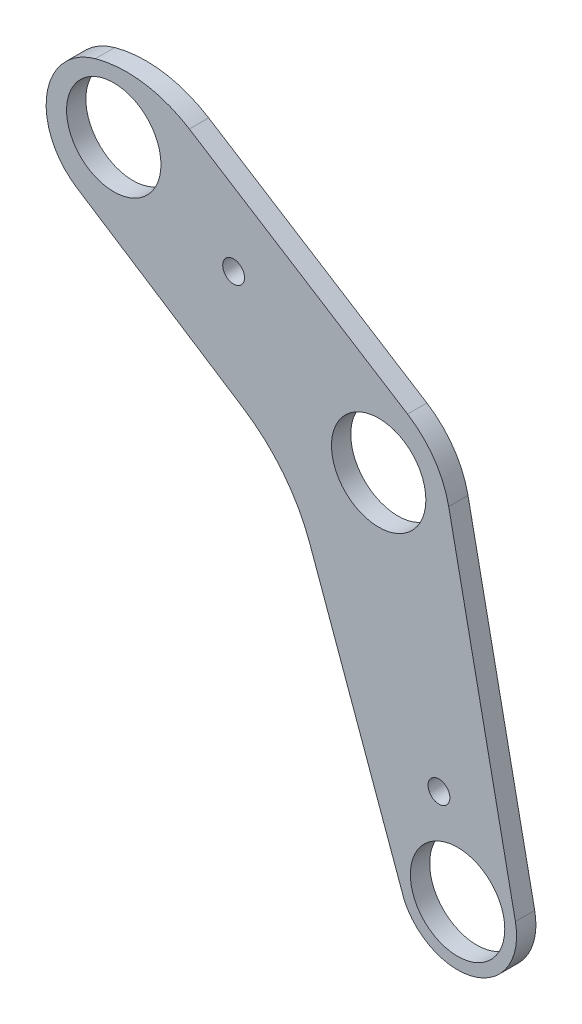
ISO-10303-21;
HEADER;
FILE_DESCRIPTION(('STEP AP214'),'2;1');
FILE_NAME('part.step','',(''),(''),'','','');
FILE_SCHEMA(('AUTOMOTIVE_DESIGN { 1 0 10303 214 1 1 1 1 }'));
ENDSEC;
DATA;
#1=APPLICATION_CONTEXT('core data for automotive mechanical design processes');
#2=APPLICATION_PROTOCOL_DEFINITION('international standard','automotive_design',2000,#1);
#3=PRODUCT_CONTEXT('',#1,'mechanical');
#4=PRODUCT('Part','Part','',(#3));
#5=PRODUCT_RELATED_PRODUCT_CATEGORY('part','',(#4));
#6=PRODUCT_DEFINITION_FORMATION('','',#4);
#7=PRODUCT_DEFINITION_CONTEXT('part definition',#1,'design');
#8=PRODUCT_DEFINITION('design','',#6,#7);
#9=PRODUCT_DEFINITION_SHAPE('','',#8);
#10=(LENGTH_UNIT() NAMED_UNIT(*) SI_UNIT(.MILLI.,.METRE.));
#11=(NAMED_UNIT(*) PLANE_ANGLE_UNIT() SI_UNIT($,.RADIAN.));
#12=(NAMED_UNIT(*) SI_UNIT($,.STERADIAN.) SOLID_ANGLE_UNIT());
#13=UNCERTAINTY_MEASURE_WITH_UNIT(LENGTH_MEASURE(1.E-05),#10,'distance_accuracy_value','');
#14=(GEOMETRIC_REPRESENTATION_CONTEXT(3) GLOBAL_UNCERTAINTY_ASSIGNED_CONTEXT((#13)) GLOBAL_UNIT_ASSIGNED_CONTEXT((#10,
#11,#12)) REPRESENTATION_CONTEXT('',''));
#15=CARTESIAN_POINT('',(0.,0.,0.));
#16=DIRECTION('',(0.,0.,1.));
#17=DIRECTION('',(1.,0.,0.));
#18=AXIS2_PLACEMENT_3D('',#15,#16,#17);
#19=CARTESIAN_POINT('',(-130.990896357706,174.574150066505,5.842));
#20=DIRECTION('',(0.533898973012235,0.845548275745673,0.));
#21=DIRECTION('',(-0.845548275745673,0.533898973012235,0.));
#22=AXIS2_PLACEMENT_3D('',#19,#20,#21);
#23=PLANE('',#22);
#24=DIRECTION('',(0.845548275745673,-0.533898973012235,0.));
#25=VECTOR('',#24,1.);
#26=CARTESIAN_POINT('',(-130.990896357706,174.574150066505,5.842));
#27=LINE('',#26,#25);
#28=CARTESIAN_POINT('',(-108.110462510506,160.126908574206,5.842));
#29=VERTEX_POINT('',#28);
#30=CARTESIAN_POINT('',(-42.05056185803,118.415141041425,5.842));
#31=VERTEX_POINT('',#30);
#32=EDGE_CURVE('E123',#29,#31,#27,.T.);
#33=ORIENTED_EDGE('',*,*,#32,.T.);
#34=DIRECTION('',(0.,0.,-1.));
#35=VECTOR('',#34,1.);
#36=CARTESIAN_POINT('',(-42.05056185803,118.415141041425,5.842));
#37=LINE('',#36,#35);
#38=CARTESIAN_POINT('',(-42.05056185803,118.415141041425,0.));
#39=VERTEX_POINT('',#38);
#40=EDGE_CURVE('E175',#31,#39,#37,.T.);
#41=ORIENTED_EDGE('',*,*,#40,.T.);
#42=DIRECTION('',(0.845548275745673,-0.533898973012235,0.));
#43=VECTOR('',#42,1.);
#44=CARTESIAN_POINT('',(-130.990896357706,174.574150066505,0.));
#45=LINE('',#44,#43);
#46=CARTESIAN_POINT('',(-108.110462510506,160.126908574206,0.));
#47=VERTEX_POINT('',#46);
#48=EDGE_CURVE('E147',#47,#39,#45,.T.);
#49=ORIENTED_EDGE('',*,*,#48,.F.);
#50=DIRECTION('',(0.,0.,-1.));
#51=VECTOR('',#50,1.);
#52=CARTESIAN_POINT('',(-108.110462510506,160.126908574206,5.842));
#53=LINE('',#52,#51);
#54=EDGE_CURVE('E169',#47,#29,#53,.F.);
#55=ORIENTED_EDGE('',*,*,#54,.T.);
#56=EDGE_LOOP('',(#33,#41,#49,#55));
#57=FACE_BOUND('',#56,.T.);
#58=ADVANCED_FACE('F39',(#57),#23,.T.);
#59=CARTESIAN_POINT('',(-77.4849538623172,85.8604140235499,5.842));
#60=DIRECTION('',(-0.542922711154153,-0.839782668142791,0.));
#61=DIRECTION('',(0.839782668142791,-0.542922711154153,0.));
#62=AXIS2_PLACEMENT_3D('',#59,#60,#61);
#63=PLANE('',#62);
#64=DIRECTION('',(-0.839782668142791,0.542922711154153,0.));
#65=VECTOR('',#64,1.);
#66=CARTESIAN_POINT('',(-77.4849538623172,85.8604140235499,5.842));
#67=LINE('',#66,#65);
#68=CARTESIAN_POINT('',(-91.8703690666621,95.1606400464251,5.842));
#69=VERTEX_POINT('',#68);
#70=CARTESIAN_POINT('',(-142.180328470816,127.686221478304,5.842));
#71=VERTEX_POINT('',#70);
#72=EDGE_CURVE('E132',#69,#71,#67,.T.);
#73=ORIENTED_EDGE('',*,*,#72,.T.);
#74=DIRECTION('',(0.,0.,-1.));
#75=VECTOR('',#74,1.);
#76=CARTESIAN_POINT('',(-142.180328470816,127.686221478304,5.842));
#77=LINE('',#76,#75);
#78=CARTESIAN_POINT('',(-142.180328470816,127.686221478304,0.));
#79=VERTEX_POINT('',#78);
#80=EDGE_CURVE('E200',#71,#79,#77,.T.);
#81=ORIENTED_EDGE('',*,*,#80,.T.);
#82=DIRECTION('',(-0.839782668142791,0.542922711154153,0.));
#83=VECTOR('',#82,1.);
#84=CARTESIAN_POINT('',(-77.4849538623172,85.8604140235499,0.));
#85=LINE('',#84,#83);
#86=CARTESIAN_POINT('',(-91.8703690666621,95.1606400464251,0.));
#87=VERTEX_POINT('',#86);
#88=EDGE_CURVE('E161',#87,#79,#85,.T.);
#89=ORIENTED_EDGE('',*,*,#88,.F.);
#90=DIRECTION('',(0.,0.,-1.));
#91=VECTOR('',#90,1.);
#92=CARTESIAN_POINT('',(-91.8703690666621,95.1606400464251,5.842));
#93=LINE('',#92,#91);
#94=EDGE_CURVE('E191',#87,#69,#93,.F.);
#95=ORIENTED_EDGE('',*,*,#94,.T.);
#96=EDGE_LOOP('',(#73,#81,#89,#95));
#97=FACE_BOUND('',#96,.T.);
#98=ADVANCED_FACE('F209',(#97),#63,.T.);
#99=CARTESIAN_POINT('',(-77.4849538623172,85.8604140235499,5.842));
#100=DIRECTION('',(-0.94059293929414,-0.339536334653612,0.));
#101=DIRECTION('',(0.339536334653612,-0.94059293929414,0.));
#102=AXIS2_PLACEMENT_3D('',#99,#100,#101);
#103=PLANE('',#102);
#104=DIRECTION('',(-0.339536334653612,0.94059293929414,0.));
#105=VECTOR('',#104,1.);
#106=CARTESIAN_POINT('',(-77.4849538623172,85.8604140235499,5.842));
#107=LINE('',#106,#105);
#108=CARTESIAN_POINT('',(-43.0106471295773,-9.64126338295301,5.842));
#109=VERTEX_POINT('',#108);
#110=CARTESIAN_POINT('',(-71.6687214771508,69.7481263051748,5.842));
#111=VERTEX_POINT('',#110);
#112=EDGE_CURVE('E137',#109,#111,#107,.T.);
#113=ORIENTED_EDGE('',*,*,#112,.T.);
#114=DIRECTION('',(0.,0.,-1.));
#115=VECTOR('',#114,1.);
#116=CARTESIAN_POINT('',(-71.6687214771508,69.7481263051748,0.));
#117=LINE('',#116,#115);
#118=CARTESIAN_POINT('',(-71.6687214771508,69.7481263051748,0.));
#119=VERTEX_POINT('',#118);
#120=EDGE_CURVE('E187',#111,#119,#117,.T.);
#121=ORIENTED_EDGE('',*,*,#120,.T.);
#122=DIRECTION('',(-0.339536334653612,0.94059293929414,0.));
#123=VECTOR('',#122,1.);
#124=CARTESIAN_POINT('',(-77.4849538623172,85.8604140235499,0.));
#125=LINE('',#124,#123);
#126=CARTESIAN_POINT('',(-43.0106471295773,-9.64126338295301,0.));
#127=VERTEX_POINT('',#126);
#128=EDGE_CURVE('E157',#127,#119,#125,.T.);
#129=ORIENTED_EDGE('',*,*,#128,.F.);
#130=DIRECTION('',(0.,0.,-1.));
#131=VECTOR('',#130,1.);
#132=CARTESIAN_POINT('',(-43.0106471295773,-9.64126338295301,5.842));
#133=LINE('',#132,#131);
#134=EDGE_CURVE('E131',#109,#127,#133,.T.);
#135=ORIENTED_EDGE('',*,*,#134,.F.);
#136=EDGE_LOOP('',(#113,#121,#129,#135));
#137=FACE_BOUND('',#136,.T.);
#138=ADVANCED_FACE('F221',(#137),#103,.T.);
#139=CARTESIAN_POINT('',(-26.9175004372317,-1.87101839819861,5.842));
#140=DIRECTION('',(0.,0.,-1.));
#141=DIRECTION('',(-1.,0.,0.));
#142=AXIS2_PLACEMENT_3D('',#139,#140,#141);
#143=CYLINDRICAL_SURFACE('',#142,17.8708163659206);
#144=CARTESIAN_POINT('',(-26.9175004372317,-1.87101839819861,0.));
#145=DIRECTION('',(0.,0.,-1.));
#146=DIRECTION('',(-1.,0.,0.));
#147=AXIS2_PLACEMENT_3D('',#144,#145,#146);
#148=CIRCLE('',#147,17.8708163659206);
#149=CARTESIAN_POINT('',(-9.40922451134796,1.71037123259765,0.));
#150=VERTEX_POINT('',#149);
#151=EDGE_CURVE('E129',#150,#127,#148,.T.);
#152=ORIENTED_EDGE('',*,*,#151,.F.);
#153=DIRECTION('',(0.,0.,-1.));
#154=VECTOR('',#153,1.);
#155=CARTESIAN_POINT('',(-9.40922451134796,1.71037123259765,5.842));
#156=LINE('',#155,#154);
#157=CARTESIAN_POINT('',(-9.40922451134796,1.71037123259765,5.842));
#158=VERTEX_POINT('',#157);
#159=EDGE_CURVE('E114',#158,#150,#156,.T.);
#160=ORIENTED_EDGE('',*,*,#159,.F.);
#161=CARTESIAN_POINT('',(-26.9175004372317,-1.87101839819861,5.842));
#162=DIRECTION('',(0.,0.,-1.));
#163=DIRECTION('',(-1.,0.,0.));
#164=AXIS2_PLACEMENT_3D('',#161,#162,#163);
#165=CIRCLE('',#164,17.8708163659206);
#166=EDGE_CURVE('E122',#158,#109,#165,.T.);
#167=ORIENTED_EDGE('',*,*,#166,.T.);
#168=ORIENTED_EDGE('',*,*,#134,.T.);
#169=EDGE_LOOP('',(#152,#160,#167,#168));
#170=FACE_BOUND('',#169,.T.);
#171=ADVANCED_FACE('F127',(#170),#143,.T.);
#172=CARTESIAN_POINT('',(-31.981087973147,112.057039534836,5.842));
#173=DIRECTION('',(0.979713269242237,0.200404366396262,0.));
#174=DIRECTION('',(-0.200404366396262,0.979713269242238,0.));
#175=AXIS2_PLACEMENT_3D('',#172,#173,#174);
#176=PLANE('',#175);
#177=DIRECTION('',(0.200404366396262,-0.979713269242237,0.));
#178=VECTOR('',#177,1.);
#179=CARTESIAN_POINT('',(-31.981087973147,112.057039534836,0.));
#180=LINE('',#179,#178);
#181=CARTESIAN_POINT('',(-29.5945104213638,100.389820214203,0.));
#182=VERTEX_POINT('',#181);
#183=EDGE_CURVE('E151',#182,#150,#180,.T.);
#184=ORIENTED_EDGE('',*,*,#183,.F.);
#185=DIRECTION('',(0.,0.,-1.));
#186=VECTOR('',#185,1.);
#187=CARTESIAN_POINT('',(-29.5945104213638,100.389820214203,5.842));
#188=LINE('',#187,#186);
#189=CARTESIAN_POINT('',(-29.5945104213638,100.389820214203,5.842));
#190=VERTEX_POINT('',#189);
#191=EDGE_CURVE('E117',#182,#190,#188,.F.);
#192=ORIENTED_EDGE('',*,*,#191,.T.);
#193=DIRECTION('',(0.200404366396262,-0.979713269242237,0.));
#194=VECTOR('',#193,1.);
#195=CARTESIAN_POINT('',(-31.981087973147,112.057039534836,5.842));
#196=LINE('',#195,#194);
#197=EDGE_CURVE('E110',#190,#158,#196,.T.);
#198=ORIENTED_EDGE('',*,*,#197,.T.);
#199=ORIENTED_EDGE('',*,*,#159,.T.);
#200=EDGE_LOOP('',(#184,#192,#198,#199));
#201=FACE_BOUND('',#200,.T.);
#202=ADVANCED_FACE('F113',(#201),#176,.T.);
#203=CARTESIAN_POINT('',(-26.9175004372317,-1.87101839819861,5.842));
#204=DIRECTION('',(0.,0.,-1.));
#205=DIRECTION('',(-1.,0.,0.));
#206=AXIS2_PLACEMENT_3D('',#203,#204,#205);
#207=PLANE('',#206);
#208=CARTESIAN_POINT('',(-26.9175004372317,-1.87101839819861,5.842));
#209=DIRECTION('',(0.,0.,-1.));
#210=DIRECTION('',(1.,0.,0.));
#211=AXIS2_PLACEMENT_3D('',#208,#209,#210);
#212=CIRCLE('',#211,14.2875);
#213=CARTESIAN_POINT('',(-12.6300004372317,-1.87101839819861,5.842));
#214=VERTEX_POINT('',#213);
#215=EDGE_CURVE('E260',#214,#214,#212,.T.);
#216=ORIENTED_EDGE('',*,*,#215,.T.);
#217=EDGE_LOOP('',(#216));
#218=FACE_BOUND('',#217,.T.);
#219=CARTESIAN_POINT('',(-50.8,98.679,5.842));
#220=DIRECTION('',(0.,0.,-1.));
#221=DIRECTION('',(1.,0.,0.));
#222=AXIS2_PLACEMENT_3D('',#219,#220,#221);
#223=CIRCLE('',#222,14.2875);
#224=CARTESIAN_POINT('',(-36.5125,98.679,5.842));
#225=VERTEX_POINT('',#224);
#226=EDGE_CURVE('E252',#225,#225,#223,.T.);
#227=ORIENTED_EDGE('',*,*,#226,.T.);
#228=EDGE_LOOP('',(#227));
#229=FACE_BOUND('',#228,.T.);
#230=CARTESIAN_POINT('',(-94.7070787641731,129.476886964954,5.842));
#231=DIRECTION('',(0.,0.,-1.));
#232=DIRECTION('',(-1.,0.,0.));
#233=AXIS2_PLACEMENT_3D('',#230,#231,#232);
#234=CIRCLE('',#233,3.302);
#235=CARTESIAN_POINT('',(-98.0090787641731,129.476886964954,5.842));
#236=VERTEX_POINT('',#235);
#237=EDGE_CURVE('E244',#236,#236,#234,.T.);
#238=ORIENTED_EDGE('',*,*,#237,.T.);
#239=EDGE_LOOP('',(#238));
#240=FACE_BOUND('',#239,.T.);
#241=CARTESIAN_POINT('',(-32.5540017937413,24.2133734622882,5.842));
#242=DIRECTION('',(0.,0.,-1.));
#243=DIRECTION('',(-1.,0.,0.));
#244=AXIS2_PLACEMENT_3D('',#241,#242,#243);
#245=CIRCLE('',#244,3.302);
#246=CARTESIAN_POINT('',(-35.8560017937413,24.2133734622882,5.842));
#247=VERTEX_POINT('',#246);
#248=EDGE_CURVE('E236',#247,#247,#245,.T.);
#249=ORIENTED_EDGE('',*,*,#248,.T.);
#250=EDGE_LOOP('',(#249));
#251=FACE_BOUND('',#250,.T.);
#252=CARTESIAN_POINT('',(-130.990896357706,146.510317071253,5.842));
#253=DIRECTION('',(0.,0.,-1.));
#254=DIRECTION('',(1.,0.,0.));
#255=AXIS2_PLACEMENT_3D('',#252,#253,#254);
#256=CIRCLE('',#255,14.2875);
#257=CARTESIAN_POINT('',(-116.703396357706,146.510317071253,5.842));
#258=VERTEX_POINT('',#257);
#259=EDGE_CURVE('E152',#258,#258,#256,.T.);
#260=ORIENTED_EDGE('',*,*,#259,.T.);
#261=EDGE_LOOP('',(#260));
#262=FACE_BOUND('',#261,.T.);
#263=CARTESIAN_POINT('',(-127.095909990821,130.05921188869,5.842));
#264=DIRECTION('',(0.,0.,-1.));
#265=DIRECTION('',(-1.,0.,0.));
#266=AXIS2_PLACEMENT_3D('',#263,#264,#265);
#267=CIRCLE('',#266,35.56);
#268=CARTESIAN_POINT('',(-136.551110965953,164.339129836665,5.842));
#269=VERTEX_POINT('',#268);
#270=EDGE_CURVE('E172',#29,#269,#267,.F.);
#271=ORIENTED_EDGE('',*,*,#270,.T.);
#272=CARTESIAN_POINT('',(-131.148138980163,144.750605294965,5.842));
#273=DIRECTION('',(0.,0.,-1.));
#274=DIRECTION('',(-1.,0.,0.));
#275=AXIS2_PLACEMENT_3D('',#272,#273,#274);
#276=CIRCLE('',#275,20.32);
#277=EDGE_CURVE('E11',#269,#71,#276,.F.);
#278=ORIENTED_EDGE('',*,*,#277,.T.);
#279=ORIENTED_EDGE('',*,*,#72,.F.);
#280=CARTESIAN_POINT('',(-119.450842793293,52.4996805047713,5.842));
#281=DIRECTION('',(0.,0.,-1.));
#282=DIRECTION('',(-1.,0.,0.));
#283=AXIS2_PLACEMENT_3D('',#280,#281,#282);
#284=CIRCLE('',#283,50.8);
#285=EDGE_CURVE('E197',#69,#111,#284,.T.);
#286=ORIENTED_EDGE('',*,*,#285,.T.);
#287=ORIENTED_EDGE('',*,*,#112,.F.);
#288=ORIENTED_EDGE('',*,*,#166,.F.);
#289=ORIENTED_EDGE('',*,*,#197,.F.);
#290=CARTESIAN_POINT('',(-56.9676991639919,94.7905222170911,5.842));
#291=DIRECTION('',(0.,0.,-1.));
#292=DIRECTION('',(-1.,0.,0.));
#293=AXIS2_PLACEMENT_3D('',#290,#291,#292);
#294=CIRCLE('',#293,27.94);
#295=EDGE_CURVE('E184',#190,#31,#294,.F.);
#296=ORIENTED_EDGE('',*,*,#295,.T.);
#297=ORIENTED_EDGE('',*,*,#32,.F.);
#298=EDGE_LOOP('',(#271,#278,#279,#286,#287,#288,#289,#296,#297));
#299=FACE_BOUND('',#298,.T.);
#300=ADVANCED_FACE('F135',(#218,#229,#240,#251,#262,#299),#207,.F.);
#301=CARTESIAN_POINT('',(-26.9175004372317,-1.87101839819861,0.));
#302=DIRECTION('',(0.,0.,-1.));
#303=DIRECTION('',(-1.,0.,0.));
#304=AXIS2_PLACEMENT_3D('',#301,#302,#303);
#305=PLANE('',#304);
#306=CARTESIAN_POINT('',(-26.9175004372317,-1.87101839819861,0.));
#307=DIRECTION('',(0.,0.,-1.));
#308=DIRECTION('',(1.,0.,0.));
#309=AXIS2_PLACEMENT_3D('',#306,#307,#308);
#310=CIRCLE('',#309,14.2875);
#311=CARTESIAN_POINT('',(-12.6300004372317,-1.87101839819861,0.));
#312=VERTEX_POINT('',#311);
#313=EDGE_CURVE('E264',#312,#312,#310,.T.);
#314=ORIENTED_EDGE('',*,*,#313,.F.);
#315=EDGE_LOOP('',(#314));
#316=FACE_BOUND('',#315,.T.);
#317=CARTESIAN_POINT('',(-50.8,98.679,0.));
#318=DIRECTION('',(0.,0.,-1.));
#319=DIRECTION('',(1.,0.,0.));
#320=AXIS2_PLACEMENT_3D('',#317,#318,#319);
#321=CIRCLE('',#320,14.2875);
#322=CARTESIAN_POINT('',(-36.5125,98.679,0.));
#323=VERTEX_POINT('',#322);
#324=EDGE_CURVE('E256',#323,#323,#321,.T.);
#325=ORIENTED_EDGE('',*,*,#324,.F.);
#326=EDGE_LOOP('',(#325));
#327=FACE_BOUND('',#326,.T.);
#328=CARTESIAN_POINT('',(-94.7070787641731,129.476886964954,0.));
#329=DIRECTION('',(0.,0.,-1.));
#330=DIRECTION('',(-1.,0.,0.));
#331=AXIS2_PLACEMENT_3D('',#328,#329,#330);
#332=CIRCLE('',#331,3.302);
#333=CARTESIAN_POINT('',(-98.0090787641731,129.476886964954,0.));
#334=VERTEX_POINT('',#333);
#335=EDGE_CURVE('E248',#334,#334,#332,.T.);
#336=ORIENTED_EDGE('',*,*,#335,.F.);
#337=EDGE_LOOP('',(#336));
#338=FACE_BOUND('',#337,.T.);
#339=CARTESIAN_POINT('',(-32.5540017937413,24.2133734622882,0.));
#340=DIRECTION('',(0.,0.,-1.));
#341=DIRECTION('',(-1.,0.,0.));
#342=AXIS2_PLACEMENT_3D('',#339,#340,#341);
#343=CIRCLE('',#342,3.302);
#344=CARTESIAN_POINT('',(-35.8560017937413,24.2133734622882,0.));
#345=VERTEX_POINT('',#344);
#346=EDGE_CURVE('E240',#345,#345,#343,.T.);
#347=ORIENTED_EDGE('',*,*,#346,.F.);
#348=EDGE_LOOP('',(#347));
#349=FACE_BOUND('',#348,.T.);
#350=CARTESIAN_POINT('',(-130.990896357706,146.510317071253,0.));
#351=DIRECTION('',(0.,0.,-1.));
#352=DIRECTION('',(1.,0.,0.));
#353=AXIS2_PLACEMENT_3D('',#350,#351,#352);
#354=CIRCLE('',#353,14.2875);
#355=CARTESIAN_POINT('',(-116.703396357706,146.510317071253,0.));
#356=VERTEX_POINT('',#355);
#357=EDGE_CURVE('E232',#356,#356,#354,.T.);
#358=ORIENTED_EDGE('',*,*,#357,.F.);
#359=EDGE_LOOP('',(#358));
#360=FACE_BOUND('',#359,.T.);
#361=ORIENTED_EDGE('',*,*,#88,.T.);
#362=CARTESIAN_POINT('',(-131.148138980163,144.750605294965,0.));
#363=DIRECTION('',(0.,0.,-1.));
#364=DIRECTION('',(-1.,0.,0.));
#365=AXIS2_PLACEMENT_3D('',#362,#363,#364);
#366=CIRCLE('',#365,20.32);
#367=CARTESIAN_POINT('',(-136.551110965953,164.339129836665,0.));
#368=VERTEX_POINT('',#367);
#369=EDGE_CURVE('E62',#79,#368,#366,.T.);
#370=ORIENTED_EDGE('',*,*,#369,.T.);
#371=CARTESIAN_POINT('',(-127.095909990821,130.05921188869,0.));
#372=DIRECTION('',(0.,0.,-1.));
#373=DIRECTION('',(-1.,0.,0.));
#374=AXIS2_PLACEMENT_3D('',#371,#372,#373);
#375=CIRCLE('',#374,35.56);
#376=EDGE_CURVE('E165',#368,#47,#375,.T.);
#377=ORIENTED_EDGE('',*,*,#376,.T.);
#378=ORIENTED_EDGE('',*,*,#48,.T.);
#379=CARTESIAN_POINT('',(-56.9676991639919,94.7905222170911,0.));
#380=DIRECTION('',(0.,0.,-1.));
#381=DIRECTION('',(-1.,0.,0.));
#382=AXIS2_PLACEMENT_3D('',#379,#380,#381);
#383=CIRCLE('',#382,27.94);
#384=EDGE_CURVE('E179',#39,#182,#383,.T.);
#385=ORIENTED_EDGE('',*,*,#384,.T.);
#386=ORIENTED_EDGE('',*,*,#183,.T.);
#387=ORIENTED_EDGE('',*,*,#151,.T.);
#388=ORIENTED_EDGE('',*,*,#128,.T.);
#389=CARTESIAN_POINT('',(-119.450842793293,52.4996805047713,0.));
#390=DIRECTION('',(0.,0.,-1.));
#391=DIRECTION('',(-1.,0.,0.));
#392=AXIS2_PLACEMENT_3D('',#389,#390,#391);
#393=CIRCLE('',#392,50.8);
#394=EDGE_CURVE('E194',#119,#87,#393,.F.);
#395=ORIENTED_EDGE('',*,*,#394,.T.);
#396=EDGE_LOOP('',(#361,#370,#377,#378,#385,#386,#387,#388,#395));
#397=FACE_BOUND('',#396,.T.);
#398=ADVANCED_FACE('F214',(#316,#327,#338,#349,#360,#397),#305,.T.);
#399=CARTESIAN_POINT('',(-130.990896357706,146.510317071253,5.842));
#400=DIRECTION('',(0.,0.,-1.));
#401=DIRECTION('',(-1.,0.,0.));
#402=AXIS2_PLACEMENT_3D('',#399,#400,#401);
#403=CYLINDRICAL_SURFACE('',#402,14.2875);
#404=ORIENTED_EDGE('',*,*,#259,.F.);
#405=EDGE_LOOP('',(#404));
#406=FACE_BOUND('',#405,.T.);
#407=ORIENTED_EDGE('',*,*,#357,.T.);
#408=EDGE_LOOP('',(#407));
#409=FACE_BOUND('',#408,.T.);
#410=ADVANCED_FACE('F284',(#406,#409),#403,.F.);
#411=CARTESIAN_POINT('',(-32.5540017937413,24.2133734622882,5.842));
#412=DIRECTION('',(0.,0.,-1.));
#413=DIRECTION('',(-1.,0.,0.));
#414=AXIS2_PLACEMENT_3D('',#411,#412,#413);
#415=CYLINDRICAL_SURFACE('',#414,3.302);
#416=ORIENTED_EDGE('',*,*,#248,.F.);
#417=EDGE_LOOP('',(#416));
#418=FACE_BOUND('',#417,.T.);
#419=ORIENTED_EDGE('',*,*,#346,.T.);
#420=EDGE_LOOP('',(#419));
#421=FACE_BOUND('',#420,.T.);
#422=ADVANCED_FACE('F295',(#418,#421),#415,.F.);
#423=CARTESIAN_POINT('',(-94.7070787641731,129.476886964954,5.842));
#424=DIRECTION('',(0.,0.,-1.));
#425=DIRECTION('',(-1.,0.,0.));
#426=AXIS2_PLACEMENT_3D('',#423,#424,#425);
#427=CYLINDRICAL_SURFACE('',#426,3.302);
#428=ORIENTED_EDGE('',*,*,#237,.F.);
#429=EDGE_LOOP('',(#428));
#430=FACE_BOUND('',#429,.T.);
#431=ORIENTED_EDGE('',*,*,#335,.T.);
#432=EDGE_LOOP('',(#431));
#433=FACE_BOUND('',#432,.T.);
#434=ADVANCED_FACE('F301',(#430,#433),#427,.F.);
#435=CARTESIAN_POINT('',(-50.8,98.679,5.842));
#436=DIRECTION('',(0.,0.,-1.));
#437=DIRECTION('',(-1.,0.,0.));
#438=AXIS2_PLACEMENT_3D('',#435,#436,#437);
#439=CYLINDRICAL_SURFACE('',#438,14.2875);
#440=ORIENTED_EDGE('',*,*,#226,.F.);
#441=EDGE_LOOP('',(#440));
#442=FACE_BOUND('',#441,.T.);
#443=ORIENTED_EDGE('',*,*,#324,.T.);
#444=EDGE_LOOP('',(#443));
#445=FACE_BOUND('',#444,.T.);
#446=ADVANCED_FACE('F278',(#442,#445),#439,.F.);
#447=CARTESIAN_POINT('',(-26.9175004372317,-1.87101839819861,5.842));
#448=DIRECTION('',(0.,0.,-1.));
#449=DIRECTION('',(-1.,0.,0.));
#450=AXIS2_PLACEMENT_3D('',#447,#448,#449);
#451=CYLINDRICAL_SURFACE('',#450,14.2875);
#452=ORIENTED_EDGE('',*,*,#215,.F.);
#453=EDGE_LOOP('',(#452));
#454=FACE_BOUND('',#453,.T.);
#455=ORIENTED_EDGE('',*,*,#313,.T.);
#456=EDGE_LOOP('',(#455));
#457=FACE_BOUND('',#456,.T.);
#458=ADVANCED_FACE('F274',(#454,#457),#451,.F.);
#459=CARTESIAN_POINT('',(-127.095909990821,130.05921188869,5.842));
#460=DIRECTION('',(0.,0.,-1.));
#461=DIRECTION('',(-1.,0.,0.));
#462=AXIS2_PLACEMENT_3D('',#459,#460,#461);
#463=CYLINDRICAL_SURFACE('',#462,35.56);
#464=ORIENTED_EDGE('',*,*,#376,.F.);
#465=DIRECTION('',(0.,0.,-1.));
#466=VECTOR('',#465,1.);
#467=CARTESIAN_POINT('',(-136.551110965953,164.339129836665,5.842));
#468=LINE('',#467,#466);
#469=EDGE_CURVE('E48',#368,#269,#468,.F.);
#470=ORIENTED_EDGE('',*,*,#469,.T.);
#471=ORIENTED_EDGE('',*,*,#270,.F.);
#472=ORIENTED_EDGE('',*,*,#54,.F.);
#473=EDGE_LOOP('',(#464,#470,#471,#472));
#474=FACE_BOUND('',#473,.T.);
#475=ADVANCED_FACE('F277',(#474),#463,.T.);
#476=CARTESIAN_POINT('',(-56.9676991639919,94.7905222170911,5.842));
#477=DIRECTION('',(0.,0.,-1.));
#478=DIRECTION('',(-1.,0.,0.));
#479=AXIS2_PLACEMENT_3D('',#476,#477,#478);
#480=CYLINDRICAL_SURFACE('',#479,27.94);
#481=ORIENTED_EDGE('',*,*,#295,.F.);
#482=ORIENTED_EDGE('',*,*,#191,.F.);
#483=ORIENTED_EDGE('',*,*,#384,.F.);
#484=ORIENTED_EDGE('',*,*,#40,.F.);
#485=EDGE_LOOP('',(#481,#482,#483,#484));
#486=FACE_BOUND('',#485,.T.);
#487=ADVANCED_FACE('F223',(#486),#480,.T.);
#488=CARTESIAN_POINT('',(-119.450842793293,52.4996805047713,5.842));
#489=DIRECTION('',(0.,0.,1.));
#490=DIRECTION('',(1.,0.,0.));
#491=AXIS2_PLACEMENT_3D('',#488,#489,#490);
#492=CYLINDRICAL_SURFACE('',#491,50.8);
#493=ORIENTED_EDGE('',*,*,#285,.F.);
#494=ORIENTED_EDGE('',*,*,#94,.F.);
#495=ORIENTED_EDGE('',*,*,#394,.F.);
#496=ORIENTED_EDGE('',*,*,#120,.F.);
#497=EDGE_LOOP('',(#493,#494,#495,#496));
#498=FACE_BOUND('',#497,.T.);
#499=ADVANCED_FACE('F219',(#498),#492,.F.);
#500=CARTESIAN_POINT('',(-131.148138980163,144.750605294965,5.842));
#501=DIRECTION('',(0.,0.,-1.));
#502=DIRECTION('',(-1.,0.,0.));
#503=AXIS2_PLACEMENT_3D('',#500,#501,#502);
#504=CYLINDRICAL_SURFACE('',#503,20.32);
#505=ORIENTED_EDGE('',*,*,#277,.F.);
#506=ORIENTED_EDGE('',*,*,#469,.F.);
#507=ORIENTED_EDGE('',*,*,#369,.F.);
#508=ORIENTED_EDGE('',*,*,#80,.F.);
#509=EDGE_LOOP('',(#505,#506,#507,#508));
#510=FACE_BOUND('',#509,.T.);
#511=ADVANCED_FACE('F41',(#510),#504,.T.);
#512=CLOSED_SHELL('',(#58,#98,#138,#171,#202,#300,#398,#410,#422,#434,#446,#458,#475,#487,#499,#511));
#513=MANIFOLD_SOLID_BREP('B2',#512);
#514=ADVANCED_BREP_SHAPE_REPRESENTATION('',(#18,#513),#14);
#515=SHAPE_DEFINITION_REPRESENTATION(#9,#514);
ENDSEC;
END-ISO-10303-21;
